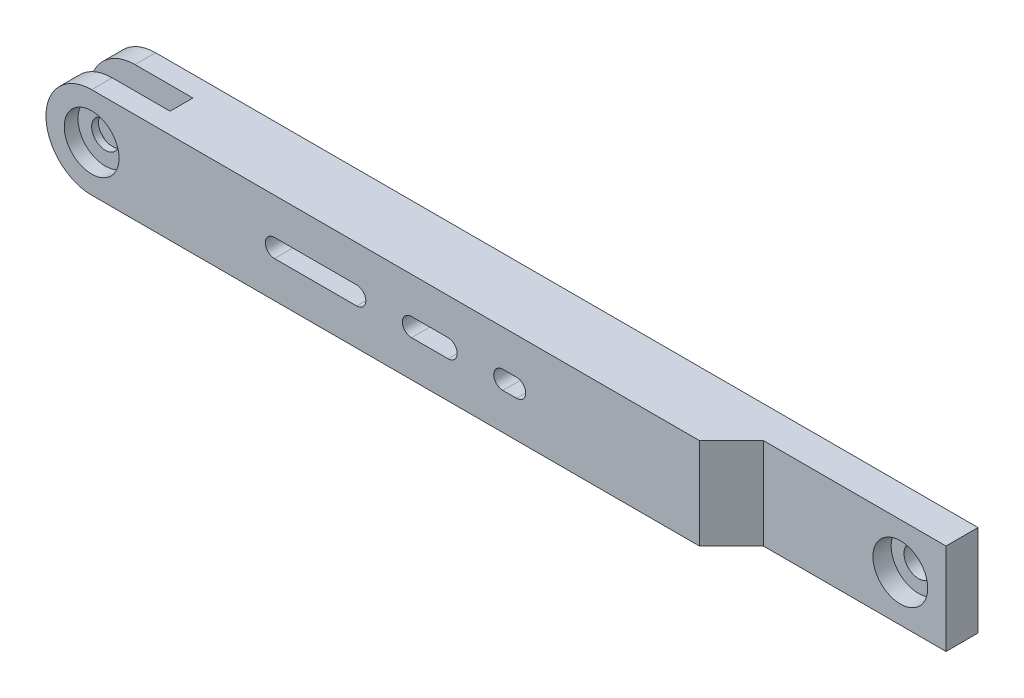
ISO-10303-21;
HEADER;
FILE_DESCRIPTION(('STEP AP214'),'2;1');
FILE_NAME('part.step','',(''),(''),'','','');
FILE_SCHEMA(('AUTOMOTIVE_DESIGN { 1 0 10303 214 1 1 1 1 }'));
ENDSEC;
DATA;
#1=APPLICATION_CONTEXT('core data for automotive mechanical design processes');
#2=APPLICATION_PROTOCOL_DEFINITION('international standard','automotive_design',2000,#1);
#3=PRODUCT_CONTEXT('',#1,'mechanical');
#4=PRODUCT('Part','Part','',(#3));
#5=PRODUCT_RELATED_PRODUCT_CATEGORY('part','',(#4));
#6=PRODUCT_DEFINITION_FORMATION('','',#4);
#7=PRODUCT_DEFINITION_CONTEXT('part definition',#1,'design');
#8=PRODUCT_DEFINITION('design','',#6,#7);
#9=PRODUCT_DEFINITION_SHAPE('','',#8);
#10=(LENGTH_UNIT() NAMED_UNIT(*) SI_UNIT(.MILLI.,.METRE.));
#11=(NAMED_UNIT(*) PLANE_ANGLE_UNIT() SI_UNIT($,.RADIAN.));
#12=(NAMED_UNIT(*) SI_UNIT($,.STERADIAN.) SOLID_ANGLE_UNIT());
#13=UNCERTAINTY_MEASURE_WITH_UNIT(LENGTH_MEASURE(1.E-05),#10,'distance_accuracy_value','');
#14=(GEOMETRIC_REPRESENTATION_CONTEXT(3) GLOBAL_UNCERTAINTY_ASSIGNED_CONTEXT((#13)) GLOBAL_UNIT_ASSIGNED_CONTEXT((#10,
#11,#12)) REPRESENTATION_CONTEXT('',''));
#15=CARTESIAN_POINT('',(0.,0.,0.));
#16=DIRECTION('',(0.,0.,1.));
#17=DIRECTION('',(1.,0.,0.));
#18=AXIS2_PLACEMENT_3D('',#15,#16,#17);
#19=CARTESIAN_POINT('',(-52.2921634722447,0.,-13.));
#20=DIRECTION('',(0.,0.,1.));
#21=DIRECTION('',(1.,0.,0.));
#22=AXIS2_PLACEMENT_3D('',#19,#20,#21);
#23=CYLINDRICAL_SURFACE('',#22,1.5);
#24=CARTESIAN_POINT('',(-52.2921634722447,0.,-5.25));
#25=DIRECTION('',(0.,0.,1.));
#26=DIRECTION('',(1.,0.,0.));
#27=AXIS2_PLACEMENT_3D('',#24,#25,#26);
#28=CIRCLE('',#27,1.5);
#29=CARTESIAN_POINT('',(-50.7921634722447,0.,-5.25));
#30=VERTEX_POINT('',#29);
#31=EDGE_CURVE('E249',#30,#30,#28,.F.);
#32=ORIENTED_EDGE('',*,*,#31,.T.);
#33=EDGE_LOOP('',(#32));
#34=FACE_BOUND('',#33,.T.);
#35=CARTESIAN_POINT('',(-52.2921634722447,0.,-4.5));
#36=DIRECTION('',(0.,0.,1.));
#37=DIRECTION('',(1.,0.,0.));
#38=AXIS2_PLACEMENT_3D('',#35,#36,#37);
#39=CIRCLE('',#38,1.5);
#40=CARTESIAN_POINT('',(-50.7921634722447,0.,-4.5));
#41=VERTEX_POINT('',#40);
#42=EDGE_CURVE('E256',#41,#41,#39,.F.);
#43=ORIENTED_EDGE('',*,*,#42,.F.);
#44=EDGE_LOOP('',(#43));
#45=FACE_BOUND('',#44,.T.);
#46=ADVANCED_FACE('F34',(#34,#45),#23,.F.);
#47=CARTESIAN_POINT('',(-57.2867382607771,-5.,-5.));
#48=DIRECTION('',(1.,0.,0.));
#49=DIRECTION('',(0.,0.,-1.));
#50=AXIS2_PLACEMENT_3D('',#47,#48,#49);
#51=PLANE('',#50);
#52=DIRECTION('',(0.,0.,1.));
#53=VECTOR('',#52,1.);
#54=CARTESIAN_POINT('',(-57.2867382607771,0.232857642684231,-10.));
#55=LINE('',#54,#53);
#56=CARTESIAN_POINT('',(-57.2867382607771,0.232857642684232,-5.25));
#57=VERTEX_POINT('',#56);
#58=CARTESIAN_POINT('',(-57.2867382607771,0.232857642684231,-3.));
#59=VERTEX_POINT('',#58);
#60=EDGE_CURVE('E321',#57,#59,#55,.T.);
#61=ORIENTED_EDGE('',*,*,#60,.F.);
#62=DIRECTION('',(0.,-1.,0.));
#63=VECTOR('',#62,1.);
#64=CARTESIAN_POINT('',(-57.2867382607771,-5.,-5.25));
#65=LINE('',#64,#63);
#66=CARTESIAN_POINT('',(-57.2867382607771,-0.23285764268423,-5.25));
#67=VERTEX_POINT('',#66);
#68=EDGE_CURVE('E244',#57,#67,#65,.T.);
#69=ORIENTED_EDGE('',*,*,#68,.T.);
#70=DIRECTION('',(0.,0.,1.));
#71=VECTOR('',#70,1.);
#72=CARTESIAN_POINT('',(-57.2867382607771,-0.232857642684231,-10.));
#73=LINE('',#72,#71);
#74=CARTESIAN_POINT('',(-57.2867382607771,-0.232857642684231,-3.));
#75=VERTEX_POINT('',#74);
#76=EDGE_CURVE('E301',#67,#75,#73,.T.);
#77=ORIENTED_EDGE('',*,*,#76,.T.);
#78=DIRECTION('',(0.,-1.,0.));
#79=VECTOR('',#78,1.);
#80=CARTESIAN_POINT('',(-57.2867382607771,0.,-3.));
#81=LINE('',#80,#79);
#82=EDGE_CURVE('E351',#59,#75,#81,.T.);
#83=ORIENTED_EDGE('',*,*,#82,.F.);
#84=EDGE_LOOP('',(#61,#69,#77,#83));
#85=FACE_BOUND('',#84,.T.);
#86=ADVANCED_FACE('F443',(#85),#51,.F.);
#87=CARTESIAN_POINT('',(-52.2921634722447,0.,-10.));
#88=DIRECTION('',(0.,0.,1.));
#89=DIRECTION('',(1.,0.,0.));
#90=AXIS2_PLACEMENT_3D('',#87,#88,#89);
#91=CYLINDRICAL_SURFACE('',#90,5.);
#92=CARTESIAN_POINT('',(-52.2921634722447,0.,-5.25));
#93=DIRECTION('',(0.,0.,1.));
#94=DIRECTION('',(1.,0.,0.));
#95=AXIS2_PLACEMENT_3D('',#92,#93,#94);
#96=CIRCLE('',#95,5.);
#97=CARTESIAN_POINT('',(-52.2921634722447,5.,-5.25));
#98=VERTEX_POINT('',#97);
#99=EDGE_CURVE('E247',#57,#98,#96,.F.);
#100=ORIENTED_EDGE('',*,*,#99,.F.);
#101=ORIENTED_EDGE('',*,*,#60,.T.);
#102=CARTESIAN_POINT('',(-52.2921634722447,0.,-3.));
#103=DIRECTION('',(0.,0.,1.));
#104=DIRECTION('',(1.,0.,0.));
#105=AXIS2_PLACEMENT_3D('',#102,#103,#104);
#106=CIRCLE('',#105,5.);
#107=CARTESIAN_POINT('',(-52.2921634722447,5.,-3.));
#108=VERTEX_POINT('',#107);
#109=EDGE_CURVE('E306',#108,#59,#106,.T.);
#110=ORIENTED_EDGE('',*,*,#109,.F.);
#111=DIRECTION('',(0.,0.,1.));
#112=VECTOR('',#111,1.);
#113=CARTESIAN_POINT('',(-52.2921634722447,5.,-10.));
#114=LINE('',#113,#112);
#115=EDGE_CURVE('E314',#98,#108,#114,.T.);
#116=ORIENTED_EDGE('',*,*,#115,.F.);
#117=EDGE_LOOP('',(#100,#101,#110,#116));
#118=FACE_BOUND('',#117,.T.);
#119=ADVANCED_FACE('F450',(#118),#91,.T.);
#120=CARTESIAN_POINT('',(-52.2921634722447,0.,-10.));
#121=DIRECTION('',(0.,0.,1.));
#122=DIRECTION('',(1.,0.,0.));
#123=AXIS2_PLACEMENT_3D('',#120,#121,#122);
#124=CYLINDRICAL_SURFACE('',#123,5.);
#125=CARTESIAN_POINT('',(-52.2921634722447,0.,-5.25));
#126=DIRECTION('',(0.,0.,1.));
#127=DIRECTION('',(1.,0.,0.));
#128=AXIS2_PLACEMENT_3D('',#125,#126,#127);
#129=CIRCLE('',#128,5.);
#130=CARTESIAN_POINT('',(-52.2921634722447,-5.,-5.25));
#131=VERTEX_POINT('',#130);
#132=EDGE_CURVE('E11',#131,#67,#129,.F.);
#133=ORIENTED_EDGE('',*,*,#132,.F.);
#134=DIRECTION('',(0.,0.,1.));
#135=VECTOR('',#134,1.);
#136=CARTESIAN_POINT('',(-52.2921634722447,-5.,-10.));
#137=LINE('',#136,#135);
#138=CARTESIAN_POINT('',(-52.2921634722447,-5.,-3.));
#139=VERTEX_POINT('',#138);
#140=EDGE_CURVE('E307',#131,#139,#137,.T.);
#141=ORIENTED_EDGE('',*,*,#140,.T.);
#142=CARTESIAN_POINT('',(-52.2921634722447,0.,-3.));
#143=DIRECTION('',(0.,0.,1.));
#144=DIRECTION('',(1.,0.,0.));
#145=AXIS2_PLACEMENT_3D('',#142,#143,#144);
#146=CIRCLE('',#145,5.);
#147=EDGE_CURVE('E298',#75,#139,#146,.T.);
#148=ORIENTED_EDGE('',*,*,#147,.F.);
#149=ORIENTED_EDGE('',*,*,#76,.F.);
#150=EDGE_LOOP('',(#133,#141,#148,#149));
#151=FACE_BOUND('',#150,.T.);
#152=ADVANCED_FACE('F456',(#151),#124,.T.);
#153=CARTESIAN_POINT('',(-52.2921634722447,0.,-7.75000000000001));
#154=DIRECTION('',(0.,0.,-1.));
#155=DIRECTION('',(-1.,0.,0.));
#156=AXIS2_PLACEMENT_3D('',#153,#154,#155);
#157=CIRCLE('',#156,1.5);
#158=CARTESIAN_POINT('',(-53.7921634722447,0.,-7.75000000000001));
#159=VERTEX_POINT('',#158);
#160=EDGE_CURVE('E241',#159,#159,#157,.F.);
#161=ORIENTED_EDGE('',*,*,#160,.T.);
#162=EDGE_LOOP('',(#161));
#163=FACE_BOUND('',#162,.T.);
#164=CARTESIAN_POINT('',(-52.2921634722447,0.,-10.));
#165=DIRECTION('',(0.,0.,1.));
#166=DIRECTION('',(1.,0.,0.));
#167=AXIS2_PLACEMENT_3D('',#164,#165,#166);
#168=CIRCLE('',#167,1.5);
#169=CARTESIAN_POINT('',(-50.7921634722447,0.,-10.));
#170=VERTEX_POINT('',#169);
#171=EDGE_CURVE('E259',#170,#170,#168,.T.);
#172=ORIENTED_EDGE('',*,*,#171,.F.);
#173=EDGE_LOOP('',(#172));
#174=FACE_BOUND('',#173,.T.);
#175=ADVANCED_FACE('F446',(#163,#174),#23,.F.);
#176=CARTESIAN_POINT('',(32.7132617392229,0.,-10.));
#177=DIRECTION('',(0.,0.,1.));
#178=DIRECTION('',(1.,0.,0.));
#179=AXIS2_PLACEMENT_3D('',#176,#177,#178);
#180=CYLINDRICAL_SURFACE('',#179,1.6);
#181=CARTESIAN_POINT('',(32.7132617392229,0.,-10.));
#182=DIRECTION('',(0.,0.,1.));
#183=DIRECTION('',(1.,0.,0.));
#184=AXIS2_PLACEMENT_3D('',#181,#182,#183);
#185=CIRCLE('',#184,1.6);
#186=CARTESIAN_POINT('',(34.3132617392229,0.,-10.));
#187=VERTEX_POINT('',#186);
#188=EDGE_CURVE('E282',#187,#187,#185,.T.);
#189=ORIENTED_EDGE('',*,*,#188,.F.);
#190=EDGE_LOOP('',(#189));
#191=FACE_BOUND('',#190,.T.);
#192=CARTESIAN_POINT('',(32.7132617392229,0.,-8.50000000000001));
#193=DIRECTION('',(0.,0.,1.));
#194=DIRECTION('',(1.,0.,0.));
#195=AXIS2_PLACEMENT_3D('',#192,#193,#194);
#196=CIRCLE('',#195,1.6);
#197=CARTESIAN_POINT('',(34.3132617392229,0.,-8.50000000000001));
#198=VERTEX_POINT('',#197);
#199=EDGE_CURVE('E266',#198,#198,#196,.F.);
#200=ORIENTED_EDGE('',*,*,#199,.F.);
#201=EDGE_LOOP('',(#200));
#202=FACE_BOUND('',#201,.T.);
#203=ADVANCED_FACE('F455',(#191,#202),#180,.F.);
#204=CARTESIAN_POINT('',(-57.2867382607771,-0.232857642684231,-10.));
#205=VERTEX_POINT('',#204);
#206=CARTESIAN_POINT('',(-57.2867382607771,-0.232857642684231,-7.75000000000001));
#207=VERTEX_POINT('',#206);
#208=EDGE_CURVE('E308',#205,#207,#73,.T.);
#209=ORIENTED_EDGE('',*,*,#208,.T.);
#210=DIRECTION('',(0.,1.,0.));
#211=VECTOR('',#210,1.);
#212=CARTESIAN_POINT('',(-57.2867382607771,-5.,-7.75000000000001));
#213=LINE('',#212,#211);
#214=CARTESIAN_POINT('',(-57.2867382607771,0.232857642684232,-7.75000000000001));
#215=VERTEX_POINT('',#214);
#216=EDGE_CURVE('E49',#207,#215,#213,.T.);
#217=ORIENTED_EDGE('',*,*,#216,.T.);
#218=CARTESIAN_POINT('',(-57.2867382607771,0.232857642684231,-10.));
#219=VERTEX_POINT('',#218);
#220=EDGE_CURVE('E317',#219,#215,#55,.T.);
#221=ORIENTED_EDGE('',*,*,#220,.F.);
#222=DIRECTION('',(0.,1.,0.));
#223=VECTOR('',#222,1.);
#224=CARTESIAN_POINT('',(-57.2867382607771,-5.,-10.));
#225=LINE('',#224,#223);
#226=EDGE_CURVE('E431',#205,#219,#225,.T.);
#227=ORIENTED_EDGE('',*,*,#226,.F.);
#228=EDGE_LOOP('',(#209,#217,#221,#227));
#229=FACE_BOUND('',#228,.T.);
#230=ADVANCED_FACE('F36',(#229),#51,.F.);
#231=CARTESIAN_POINT('',(-1.55381345925209,-5.,-10.));
#232=DIRECTION('',(0.,0.,1.));
#233=DIRECTION('',(1.,0.,0.));
#234=AXIS2_PLACEMENT_3D('',#231,#232,#233);
#235=PLANE('',#234);
#236=ORIENTED_EDGE('',*,*,#171,.T.);
#237=EDGE_LOOP('',(#236));
#238=FACE_BOUND('',#237,.T.);
#239=ORIENTED_EDGE('',*,*,#188,.T.);
#240=EDGE_LOOP('',(#239));
#241=FACE_BOUND('',#240,.T.);
#242=DIRECTION('',(-1.,0.,0.));
#243=VECTOR('',#242,1.);
#244=CARTESIAN_POINT('',(-7.2867382607771,-1.,-10.));
#245=LINE('',#244,#243);
#246=CARTESIAN_POINT('',(-5.7867382607771,-1.,-10.));
#247=VERTEX_POINT('',#246);
#248=CARTESIAN_POINT('',(-7.2867382607771,-1.,-10.));
#249=VERTEX_POINT('',#248);
#250=EDGE_CURVE('E370',#247,#249,#245,.T.);
#251=ORIENTED_EDGE('',*,*,#250,.F.);
#252=CARTESIAN_POINT('',(-5.7867382607771,0.,-10.));
#253=DIRECTION('',(0.,0.,-1.));
#254=DIRECTION('',(-1.,0.,0.));
#255=AXIS2_PLACEMENT_3D('',#252,#253,#254);
#256=CIRCLE('',#255,1.);
#257=CARTESIAN_POINT('',(-5.7867382607771,0.999999999999999,-10.));
#258=VERTEX_POINT('',#257);
#259=EDGE_CURVE('E368',#258,#247,#256,.T.);
#260=ORIENTED_EDGE('',*,*,#259,.F.);
#261=DIRECTION('',(1.,0.,0.));
#262=VECTOR('',#261,1.);
#263=CARTESIAN_POINT('',(-5.7867382607771,0.999999999999999,-10.));
#264=LINE('',#263,#262);
#265=CARTESIAN_POINT('',(-7.2867382607771,0.999999999999999,-10.));
#266=VERTEX_POINT('',#265);
#267=EDGE_CURVE('E376',#266,#258,#264,.T.);
#268=ORIENTED_EDGE('',*,*,#267,.F.);
#269=CARTESIAN_POINT('',(-7.2867382607771,0.,-10.));
#270=DIRECTION('',(0.,0.,-1.));
#271=DIRECTION('',(-1.,0.,0.));
#272=AXIS2_PLACEMENT_3D('',#269,#270,#271);
#273=CIRCLE('',#272,0.999999999999999);
#274=EDGE_CURVE('E373',#249,#266,#273,.T.);
#275=ORIENTED_EDGE('',*,*,#274,.F.);
#276=EDGE_LOOP('',(#251,#260,#268,#275));
#277=FACE_BOUND('',#276,.T.);
#278=DIRECTION('',(-1.,0.,0.));
#279=VECTOR('',#278,1.);
#280=CARTESIAN_POINT('',(-17.2867382607771,-1.,-10.));
#281=LINE('',#280,#279);
#282=CARTESIAN_POINT('',(-13.2867382607771,-1.,-10.));
#283=VERTEX_POINT('',#282);
#284=CARTESIAN_POINT('',(-17.2867382607771,-1.,-10.));
#285=VERTEX_POINT('',#284);
#286=EDGE_CURVE('E390',#283,#285,#281,.T.);
#287=ORIENTED_EDGE('',*,*,#286,.F.);
#288=CARTESIAN_POINT('',(-13.2867382607771,0.,-10.));
#289=DIRECTION('',(0.,0.,-1.));
#290=DIRECTION('',(-1.,0.,0.));
#291=AXIS2_PLACEMENT_3D('',#288,#289,#290);
#292=CIRCLE('',#291,1.);
#293=CARTESIAN_POINT('',(-13.2867382607771,0.999999999999999,-10.));
#294=VERTEX_POINT('',#293);
#295=EDGE_CURVE('E382',#294,#283,#292,.T.);
#296=ORIENTED_EDGE('',*,*,#295,.F.);
#297=DIRECTION('',(1.,0.,0.));
#298=VECTOR('',#297,1.);
#299=CARTESIAN_POINT('',(-13.2867382607771,0.999999999999999,-10.));
#300=LINE('',#299,#298);
#301=CARTESIAN_POINT('',(-17.2867382607771,0.999999999999999,-10.));
#302=VERTEX_POINT('',#301);
#303=EDGE_CURVE('E396',#302,#294,#300,.T.);
#304=ORIENTED_EDGE('',*,*,#303,.F.);
#305=CARTESIAN_POINT('',(-17.2867382607771,0.,-10.));
#306=DIRECTION('',(0.,0.,-1.));
#307=DIRECTION('',(-1.,0.,0.));
#308=AXIS2_PLACEMENT_3D('',#305,#306,#307);
#309=CIRCLE('',#308,1.);
#310=EDGE_CURVE('E393',#285,#302,#309,.T.);
#311=ORIENTED_EDGE('',*,*,#310,.F.);
#312=EDGE_LOOP('',(#287,#296,#304,#311));
#313=FACE_BOUND('',#312,.T.);
#314=DIRECTION('',(-1.,0.,0.));
#315=VECTOR('',#314,1.);
#316=CARTESIAN_POINT('',(-32.2867382607771,-0.999999999999999,-10.));
#317=LINE('',#316,#315);
#318=CARTESIAN_POINT('',(-23.2867382607771,-0.999999999999999,-10.));
#319=VERTEX_POINT('',#318);
#320=CARTESIAN_POINT('',(-32.2867382607771,-0.999999999999999,-10.));
#321=VERTEX_POINT('',#320);
#322=EDGE_CURVE('E410',#319,#321,#317,.T.);
#323=ORIENTED_EDGE('',*,*,#322,.F.);
#324=CARTESIAN_POINT('',(-23.2867382607771,0.,-10.));
#325=DIRECTION('',(0.,0.,-1.));
#326=DIRECTION('',(-1.,0.,0.));
#327=AXIS2_PLACEMENT_3D('',#324,#325,#326);
#328=CIRCLE('',#327,0.999999999999998);
#329=CARTESIAN_POINT('',(-23.2867382607771,0.999999999999996,-10.));
#330=VERTEX_POINT('',#329);
#331=EDGE_CURVE('E402',#330,#319,#328,.T.);
#332=ORIENTED_EDGE('',*,*,#331,.F.);
#333=DIRECTION('',(1.,0.,0.));
#334=VECTOR('',#333,1.);
#335=CARTESIAN_POINT('',(-23.2867382607771,0.999999999999996,-10.));
#336=LINE('',#335,#334);
#337=CARTESIAN_POINT('',(-32.2867382607771,0.999999999999997,-10.));
#338=VERTEX_POINT('',#337);
#339=EDGE_CURVE('E416',#338,#330,#336,.T.);
#340=ORIENTED_EDGE('',*,*,#339,.F.);
#341=CARTESIAN_POINT('',(-32.2867382607771,0.,-10.));
#342=DIRECTION('',(0.,0.,-1.));
#343=DIRECTION('',(-1.,0.,0.));
#344=AXIS2_PLACEMENT_3D('',#341,#342,#343);
#345=CIRCLE('',#344,0.999999999999998);
#346=EDGE_CURVE('E413',#321,#338,#345,.T.);
#347=ORIENTED_EDGE('',*,*,#346,.F.);
#348=EDGE_LOOP('',(#323,#332,#340,#347));
#349=FACE_BOUND('',#348,.T.);
#350=DIRECTION('',(0.,1.,0.));
#351=VECTOR('',#350,1.);
#352=CARTESIAN_POINT('',(37.7132617392229,-5.,-10.));
#353=LINE('',#352,#351);
#354=CARTESIAN_POINT('',(37.7132617392229,-5.,-10.));
#355=VERTEX_POINT('',#354);
#356=CARTESIAN_POINT('',(37.7132617392229,5.,-10.));
#357=VERTEX_POINT('',#356);
#358=EDGE_CURVE('E292',#355,#357,#353,.T.);
#359=ORIENTED_EDGE('',*,*,#358,.F.);
#360=DIRECTION('',(1.,0.,0.));
#361=VECTOR('',#360,1.);
#362=CARTESIAN_POINT('',(-1.55381345925209,-5.,-10.));
#363=LINE('',#362,#361);
#364=CARTESIAN_POINT('',(-52.2921634722447,-5.,-10.));
#365=VERTEX_POINT('',#364);
#366=EDGE_CURVE('E429',#365,#355,#363,.T.);
#367=ORIENTED_EDGE('',*,*,#366,.F.);
#368=CARTESIAN_POINT('',(-52.2921634722447,0.,-10.));
#369=DIRECTION('',(0.,0.,1.));
#370=DIRECTION('',(1.,0.,0.));
#371=AXIS2_PLACEMENT_3D('',#368,#369,#370);
#372=CIRCLE('',#371,5.);
#373=EDGE_CURVE('E299',#205,#365,#372,.T.);
#374=ORIENTED_EDGE('',*,*,#373,.F.);
#375=ORIENTED_EDGE('',*,*,#226,.T.);
#376=CARTESIAN_POINT('',(-52.2921634722447,0.,-10.));
#377=DIRECTION('',(0.,0.,1.));
#378=DIRECTION('',(1.,0.,0.));
#379=AXIS2_PLACEMENT_3D('',#376,#377,#378);
#380=CIRCLE('',#379,5.);
#381=CARTESIAN_POINT('',(-52.2921634722447,5.,-10.));
#382=VERTEX_POINT('',#381);
#383=EDGE_CURVE('E311',#382,#219,#380,.T.);
#384=ORIENTED_EDGE('',*,*,#383,.F.);
#385=DIRECTION('',(1.,0.,0.));
#386=VECTOR('',#385,1.);
#387=CARTESIAN_POINT('',(-1.55381345925209,5.,-10.));
#388=LINE('',#387,#386);
#389=EDGE_CURVE('E422',#382,#357,#388,.T.);
#390=ORIENTED_EDGE('',*,*,#389,.T.);
#391=EDGE_LOOP('',(#359,#367,#374,#375,#384,#390));
#392=FACE_BOUND('',#391,.T.);
#393=ADVANCED_FACE('F471',(#238,#241,#277,#313,#349,#392),#235,.F.);
#394=CARTESIAN_POINT('',(0.,0.,-3.));
#395=DIRECTION('',(0.,0.,1.));
#396=DIRECTION('',(1.,0.,0.));
#397=AXIS2_PLACEMENT_3D('',#394,#395,#396);
#398=PLANE('',#397);
#399=CARTESIAN_POINT('',(-52.2921634722447,0.,-3.));
#400=DIRECTION('',(0.,0.,1.));
#401=DIRECTION('',(1.,0.,0.));
#402=AXIS2_PLACEMENT_3D('',#399,#400,#401);
#403=CIRCLE('',#402,3.);
#404=CARTESIAN_POINT('',(-49.2921634722447,0.,-3.));
#405=VERTEX_POINT('',#404);
#406=EDGE_CURVE('E252',#405,#405,#403,.T.);
#407=ORIENTED_EDGE('',*,*,#406,.F.);
#408=EDGE_LOOP('',(#407));
#409=FACE_BOUND('',#408,.T.);
#410=DIRECTION('',(-1.,0.,0.));
#411=VECTOR('',#410,1.);
#412=CARTESIAN_POINT('',(0.,5.,-3.));
#413=LINE('',#412,#411);
#414=CARTESIAN_POINT('',(14.2132617392229,5.,-3.));
#415=VERTEX_POINT('',#414);
#416=EDGE_CURVE('E348',#415,#108,#413,.T.);
#417=ORIENTED_EDGE('',*,*,#416,.T.);
#418=ORIENTED_EDGE('',*,*,#109,.T.);
#419=ORIENTED_EDGE('',*,*,#82,.T.);
#420=ORIENTED_EDGE('',*,*,#147,.T.);
#421=DIRECTION('',(1.,0.,0.));
#422=VECTOR('',#421,1.);
#423=CARTESIAN_POINT('',(0.,-5.,-3.));
#424=LINE('',#423,#422);
#425=CARTESIAN_POINT('',(14.2132617392229,-5.,-3.));
#426=VERTEX_POINT('',#425);
#427=EDGE_CURVE('E354',#139,#426,#424,.T.);
#428=ORIENTED_EDGE('',*,*,#427,.T.);
#429=DIRECTION('',(0.,-1.,0.));
#430=VECTOR('',#429,1.);
#431=CARTESIAN_POINT('',(14.2132617392229,5.,-3.));
#432=LINE('',#431,#430);
#433=EDGE_CURVE('E275',#415,#426,#432,.T.);
#434=ORIENTED_EDGE('',*,*,#433,.F.);
#435=EDGE_LOOP('',(#417,#418,#419,#420,#428,#434));
#436=FACE_BOUND('',#435,.T.);
#437=CARTESIAN_POINT('',(-7.2867382607771,0.,-3.));
#438=DIRECTION('',(0.,0.,1.));
#439=DIRECTION('',(1.,0.,0.));
#440=AXIS2_PLACEMENT_3D('',#437,#438,#439);
#441=CIRCLE('',#440,0.999999999999999);
#442=CARTESIAN_POINT('',(-7.2867382607771,-1.,-3.));
#443=VERTEX_POINT('',#442);
#444=CARTESIAN_POINT('',(-7.2867382607771,0.999999999999999,-3.));
#445=VERTEX_POINT('',#444);
#446=EDGE_CURVE('E320',#443,#445,#441,.F.);
#447=ORIENTED_EDGE('',*,*,#446,.T.);
#448=DIRECTION('',(1.,0.,0.));
#449=VECTOR('',#448,1.);
#450=CARTESIAN_POINT('',(0.,0.999999999999999,-3.));
#451=LINE('',#450,#449);
#452=CARTESIAN_POINT('',(-5.7867382607771,0.999999999999999,-3.));
#453=VERTEX_POINT('',#452);
#454=EDGE_CURVE('E327',#445,#453,#451,.T.);
#455=ORIENTED_EDGE('',*,*,#454,.T.);
#456=CARTESIAN_POINT('',(-5.7867382607771,0.,-3.));
#457=DIRECTION('',(0.,0.,1.));
#458=DIRECTION('',(1.,0.,0.));
#459=AXIS2_PLACEMENT_3D('',#456,#457,#458);
#460=CIRCLE('',#459,1.);
#461=CARTESIAN_POINT('',(-5.7867382607771,-1.,-3.));
#462=VERTEX_POINT('',#461);
#463=EDGE_CURVE('E330',#453,#462,#460,.F.);
#464=ORIENTED_EDGE('',*,*,#463,.T.);
#465=DIRECTION('',(-1.,0.,0.));
#466=VECTOR('',#465,1.);
#467=CARTESIAN_POINT('',(0.,-1.,-3.));
#468=LINE('',#467,#466);
#469=EDGE_CURVE('E333',#462,#443,#468,.T.);
#470=ORIENTED_EDGE('',*,*,#469,.T.);
#471=EDGE_LOOP('',(#447,#455,#464,#470));
#472=FACE_BOUND('',#471,.T.);
#473=CARTESIAN_POINT('',(-32.2867382607771,0.,-3.));
#474=DIRECTION('',(0.,0.,1.));
#475=DIRECTION('',(1.,0.,0.));
#476=AXIS2_PLACEMENT_3D('',#473,#474,#475);
#477=CIRCLE('',#476,0.999999999999998);
#478=CARTESIAN_POINT('',(-32.2867382607771,-0.999999999999999,-3.));
#479=VERTEX_POINT('',#478);
#480=CARTESIAN_POINT('',(-32.2867382607771,0.999999999999996,-3.));
#481=VERTEX_POINT('',#480);
#482=EDGE_CURVE('E336',#479,#481,#477,.F.);
#483=ORIENTED_EDGE('',*,*,#482,.T.);
#484=DIRECTION('',(1.,0.,0.));
#485=VECTOR('',#484,1.);
#486=CARTESIAN_POINT('',(0.,0.999999999999996,-3.));
#487=LINE('',#486,#485);
#488=CARTESIAN_POINT('',(-23.2867382607771,0.999999999999997,-3.));
#489=VERTEX_POINT('',#488);
#490=EDGE_CURVE('E339',#481,#489,#487,.T.);
#491=ORIENTED_EDGE('',*,*,#490,.T.);
#492=CARTESIAN_POINT('',(-23.2867382607771,0.,-3.));
#493=DIRECTION('',(0.,0.,1.));
#494=DIRECTION('',(1.,0.,0.));
#495=AXIS2_PLACEMENT_3D('',#492,#493,#494);
#496=CIRCLE('',#495,0.999999999999998);
#497=CARTESIAN_POINT('',(-23.2867382607771,-0.999999999999999,-3.));
#498=VERTEX_POINT('',#497);
#499=EDGE_CURVE('E342',#489,#498,#496,.F.);
#500=ORIENTED_EDGE('',*,*,#499,.T.);
#501=DIRECTION('',(-1.,0.,0.));
#502=VECTOR('',#501,1.);
#503=CARTESIAN_POINT('',(0.,-1.,-3.));
#504=LINE('',#503,#502);
#505=EDGE_CURVE('E345',#498,#479,#504,.T.);
#506=ORIENTED_EDGE('',*,*,#505,.T.);
#507=EDGE_LOOP('',(#483,#491,#500,#506));
#508=FACE_BOUND('',#507,.T.);
#509=CARTESIAN_POINT('',(-17.2867382607771,0.,-3.));
#510=DIRECTION('',(0.,0.,1.));
#511=DIRECTION('',(1.,0.,0.));
#512=AXIS2_PLACEMENT_3D('',#509,#510,#511);
#513=CIRCLE('',#512,1.);
#514=CARTESIAN_POINT('',(-17.2867382607771,-1.,-3.));
#515=VERTEX_POINT('',#514);
#516=CARTESIAN_POINT('',(-17.2867382607771,0.999999999999999,-3.));
#517=VERTEX_POINT('',#516);
#518=EDGE_CURVE('E356',#515,#517,#513,.F.);
#519=ORIENTED_EDGE('',*,*,#518,.T.);
#520=DIRECTION('',(1.,0.,0.));
#521=VECTOR('',#520,1.);
#522=CARTESIAN_POINT('',(0.,0.999999999999999,-3.));
#523=LINE('',#522,#521);
#524=CARTESIAN_POINT('',(-13.2867382607771,0.999999999999999,-3.));
#525=VERTEX_POINT('',#524);
#526=EDGE_CURVE('E359',#517,#525,#523,.T.);
#527=ORIENTED_EDGE('',*,*,#526,.T.);
#528=CARTESIAN_POINT('',(-13.2867382607771,0.,-3.));
#529=DIRECTION('',(0.,0.,1.));
#530=DIRECTION('',(1.,0.,0.));
#531=AXIS2_PLACEMENT_3D('',#528,#529,#530);
#532=CIRCLE('',#531,1.);
#533=CARTESIAN_POINT('',(-13.2867382607771,-1.,-3.));
#534=VERTEX_POINT('',#533);
#535=EDGE_CURVE('E362',#525,#534,#532,.F.);
#536=ORIENTED_EDGE('',*,*,#535,.T.);
#537=DIRECTION('',(-1.,0.,0.));
#538=VECTOR('',#537,1.);
#539=CARTESIAN_POINT('',(0.,-1.,-3.));
#540=LINE('',#539,#538);
#541=EDGE_CURVE('E365',#534,#515,#540,.T.);
#542=ORIENTED_EDGE('',*,*,#541,.T.);
#543=EDGE_LOOP('',(#519,#527,#536,#542));
#544=FACE_BOUND('',#543,.T.);
#545=ADVANCED_FACE('F474',(#409,#436,#472,#508,#544),#398,.T.);
#546=CARTESIAN_POINT('',(0.,-5.,0.));
#547=DIRECTION('',(0.,-1.,0.));
#548=DIRECTION('',(0.,0.,-1.));
#549=AXIS2_PLACEMENT_3D('',#546,#547,#548);
#550=PLANE('',#549);
#551=DIRECTION('',(1.,0.,0.));
#552=VECTOR('',#551,1.);
#553=CARTESIAN_POINT('',(-87.1338043737681,-5.,-5.25));
#554=LINE('',#553,#552);
#555=CARTESIAN_POINT('',(-45.9564821058587,-5.,-5.25));
#556=VERTEX_POINT('',#555);
#557=EDGE_CURVE('E217',#131,#556,#554,.T.);
#558=ORIENTED_EDGE('',*,*,#557,.T.);
#559=DIRECTION('',(0.,0.,-1.));
#560=VECTOR('',#559,1.);
#561=CARTESIAN_POINT('',(-45.9564821058587,-5.,-5.25));
#562=LINE('',#561,#560);
#563=CARTESIAN_POINT('',(-45.9564821058587,-5.,-7.75000000000001));
#564=VERTEX_POINT('',#563);
#565=EDGE_CURVE('E211',#556,#564,#562,.T.);
#566=ORIENTED_EDGE('',*,*,#565,.T.);
#567=DIRECTION('',(-1.,0.,0.));
#568=VECTOR('',#567,1.);
#569=CARTESIAN_POINT('',(-87.1338043737681,-5.,-7.75000000000001));
#570=LINE('',#569,#568);
#571=CARTESIAN_POINT('',(-52.2921634722447,-5.,-7.75000000000001));
#572=VERTEX_POINT('',#571);
#573=EDGE_CURVE('E220',#564,#572,#570,.T.);
#574=ORIENTED_EDGE('',*,*,#573,.T.);
#575=EDGE_CURVE('E304',#365,#572,#137,.T.);
#576=ORIENTED_EDGE('',*,*,#575,.F.);
#577=ORIENTED_EDGE('',*,*,#366,.T.);
#578=DIRECTION('',(0.,0.,-1.));
#579=VECTOR('',#578,1.);
#580=CARTESIAN_POINT('',(37.7132617392229,-5.,-3.));
#581=LINE('',#580,#579);
#582=CARTESIAN_POINT('',(37.7132617392229,-5.,-6.50000000000001));
#583=VERTEX_POINT('',#582);
#584=EDGE_CURVE('E289',#583,#355,#581,.T.);
#585=ORIENTED_EDGE('',*,*,#584,.F.);
#586=DIRECTION('',(1.,0.,0.));
#587=VECTOR('',#586,1.);
#588=CARTESIAN_POINT('',(37.7132617392229,-5.,-6.5));
#589=LINE('',#588,#587);
#590=CARTESIAN_POINT('',(17.7132617392229,-5.,-6.50000000000001));
#591=VERTEX_POINT('',#590);
#592=EDGE_CURVE('E57',#591,#583,#589,.T.);
#593=ORIENTED_EDGE('',*,*,#592,.F.);
#594=DIRECTION('',(0.707106781186551,0.,-0.707106781186544));
#595=VECTOR('',#594,1.);
#596=CARTESIAN_POINT('',(17.7132617392229,-5.,-6.50000000000001));
#597=LINE('',#596,#595);
#598=EDGE_CURVE('E276',#426,#591,#597,.T.);
#599=ORIENTED_EDGE('',*,*,#598,.F.);
#600=ORIENTED_EDGE('',*,*,#427,.F.);
#601=ORIENTED_EDGE('',*,*,#140,.F.);
#602=EDGE_LOOP('',(#558,#566,#574,#576,#577,#585,#593,#599,#600,#601));
#603=FACE_BOUND('',#602,.T.);
#604=ADVANCED_FACE('F227',(#603),#550,.T.);
#605=CARTESIAN_POINT('',(0.,5.,0.));
#606=DIRECTION('',(0.,-1.,0.));
#607=DIRECTION('',(0.,0.,-1.));
#608=AXIS2_PLACEMENT_3D('',#605,#606,#607);
#609=PLANE('',#608);
#610=DIRECTION('',(0.,0.,-1.));
#611=VECTOR('',#610,1.);
#612=CARTESIAN_POINT('',(-45.9564821058587,5.,-5.25));
#613=LINE('',#612,#611);
#614=CARTESIAN_POINT('',(-45.9564821058587,5.,-5.25));
#615=VERTEX_POINT('',#614);
#616=CARTESIAN_POINT('',(-45.9564821058587,5.,-7.75000000000001));
#617=VERTEX_POINT('',#616);
#618=EDGE_CURVE('E214',#615,#617,#613,.T.);
#619=ORIENTED_EDGE('',*,*,#618,.F.);
#620=DIRECTION('',(1.,0.,0.));
#621=VECTOR('',#620,1.);
#622=CARTESIAN_POINT('',(-87.1338043737681,5.,-5.25));
#623=LINE('',#622,#621);
#624=EDGE_CURVE('E229',#98,#615,#623,.T.);
#625=ORIENTED_EDGE('',*,*,#624,.F.);
#626=ORIENTED_EDGE('',*,*,#115,.T.);
#627=ORIENTED_EDGE('',*,*,#416,.F.);
#628=DIRECTION('',(0.707106781186551,0.,-0.707106781186544));
#629=VECTOR('',#628,1.);
#630=CARTESIAN_POINT('',(17.7132617392229,5.,-6.50000000000001));
#631=LINE('',#630,#629);
#632=CARTESIAN_POINT('',(17.7132617392229,5.,-6.50000000000001));
#633=VERTEX_POINT('',#632);
#634=EDGE_CURVE('E269',#415,#633,#631,.T.);
#635=ORIENTED_EDGE('',*,*,#634,.T.);
#636=DIRECTION('',(1.,0.,0.));
#637=VECTOR('',#636,1.);
#638=CARTESIAN_POINT('',(37.7132617392229,5.,-6.5));
#639=LINE('',#638,#637);
#640=CARTESIAN_POINT('',(37.7132617392229,5.,-6.5));
#641=VERTEX_POINT('',#640);
#642=EDGE_CURVE('E272',#633,#641,#639,.T.);
#643=ORIENTED_EDGE('',*,*,#642,.T.);
#644=DIRECTION('',(0.,0.,1.));
#645=VECTOR('',#644,1.);
#646=CARTESIAN_POINT('',(37.7132617392229,5.,-10.));
#647=LINE('',#646,#645);
#648=EDGE_CURVE('E295',#357,#641,#647,.T.);
#649=ORIENTED_EDGE('',*,*,#648,.F.);
#650=ORIENTED_EDGE('',*,*,#389,.F.);
#651=CARTESIAN_POINT('',(-52.2921634722447,5.,-7.75000000000001));
#652=VERTEX_POINT('',#651);
#653=EDGE_CURVE('E322',#382,#652,#114,.T.);
#654=ORIENTED_EDGE('',*,*,#653,.T.);
#655=DIRECTION('',(-1.,0.,0.));
#656=VECTOR('',#655,1.);
#657=CARTESIAN_POINT('',(-87.1338043737681,5.,-7.75000000000001));
#658=LINE('',#657,#656);
#659=EDGE_CURVE('E231',#617,#652,#658,.T.);
#660=ORIENTED_EDGE('',*,*,#659,.F.);
#661=EDGE_LOOP('',(#619,#625,#626,#627,#635,#643,#649,#650,#654,#660));
#662=FACE_BOUND('',#661,.T.);
#663=ADVANCED_FACE('F499',(#662),#609,.F.);
#664=CARTESIAN_POINT('',(-23.2867382607771,0.,0.));
#665=DIRECTION('',(0.,0.,-1.));
#666=DIRECTION('',(-1.,0.,0.));
#667=AXIS2_PLACEMENT_3D('',#664,#665,#666);
#668=CYLINDRICAL_SURFACE('',#667,0.999999999999998);
#669=DIRECTION('',(0.,0.,-1.));
#670=VECTOR('',#669,1.);
#671=CARTESIAN_POINT('',(-23.2867382607771,0.999999999999996,0.));
#672=LINE('',#671,#670);
#673=EDGE_CURVE('E420',#489,#330,#672,.T.);
#674=ORIENTED_EDGE('',*,*,#673,.T.);
#675=ORIENTED_EDGE('',*,*,#331,.T.);
#676=DIRECTION('',(0.,0.,-1.));
#677=VECTOR('',#676,1.);
#678=CARTESIAN_POINT('',(-23.2867382607771,-1.,0.));
#679=LINE('',#678,#677);
#680=EDGE_CURVE('E419',#498,#319,#679,.T.);
#681=ORIENTED_EDGE('',*,*,#680,.F.);
#682=ORIENTED_EDGE('',*,*,#499,.F.);
#683=EDGE_LOOP('',(#674,#675,#681,#682));
#684=FACE_BOUND('',#683,.T.);
#685=ADVANCED_FACE('F585',(#684),#668,.F.);
#686=CARTESIAN_POINT('',(-23.2867382607771,0.999999999999996,0.));
#687=DIRECTION('',(0.,1.,0.));
#688=DIRECTION('',(-1.,0.,0.));
#689=AXIS2_PLACEMENT_3D('',#686,#687,#688);
#690=PLANE('',#689);
#691=DIRECTION('',(0.,0.,-1.));
#692=VECTOR('',#691,1.);
#693=CARTESIAN_POINT('',(-32.2867382607771,0.999999999999997,0.));
#694=LINE('',#693,#692);
#695=EDGE_CURVE('E423',#481,#338,#694,.T.);
#696=ORIENTED_EDGE('',*,*,#695,.T.);
#697=ORIENTED_EDGE('',*,*,#339,.T.);
#698=ORIENTED_EDGE('',*,*,#673,.F.);
#699=ORIENTED_EDGE('',*,*,#490,.F.);
#700=EDGE_LOOP('',(#696,#697,#698,#699));
#701=FACE_BOUND('',#700,.T.);
#702=ADVANCED_FACE('F581',(#701),#690,.F.);
#703=CARTESIAN_POINT('',(-32.2867382607771,0.,0.));
#704=DIRECTION('',(0.,0.,-1.));
#705=DIRECTION('',(-1.,0.,0.));
#706=AXIS2_PLACEMENT_3D('',#703,#704,#705);
#707=CYLINDRICAL_SURFACE('',#706,0.999999999999998);
#708=DIRECTION('',(0.,0.,-1.));
#709=VECTOR('',#708,1.);
#710=CARTESIAN_POINT('',(-32.2867382607771,-0.999999999999999,0.));
#711=LINE('',#710,#709);
#712=EDGE_CURVE('E425',#479,#321,#711,.T.);
#713=ORIENTED_EDGE('',*,*,#712,.T.);
#714=ORIENTED_EDGE('',*,*,#346,.T.);
#715=ORIENTED_EDGE('',*,*,#695,.F.);
#716=ORIENTED_EDGE('',*,*,#482,.F.);
#717=EDGE_LOOP('',(#713,#714,#715,#716));
#718=FACE_BOUND('',#717,.T.);
#719=ADVANCED_FACE('F584',(#718),#707,.F.);
#720=CARTESIAN_POINT('',(-32.2867382607771,-0.999999999999999,0.));
#721=DIRECTION('',(0.,-1.,0.));
#722=DIRECTION('',(1.,0.,0.));
#723=AXIS2_PLACEMENT_3D('',#720,#721,#722);
#724=PLANE('',#723);
#725=ORIENTED_EDGE('',*,*,#680,.T.);
#726=ORIENTED_EDGE('',*,*,#322,.T.);
#727=ORIENTED_EDGE('',*,*,#712,.F.);
#728=ORIENTED_EDGE('',*,*,#505,.F.);
#729=EDGE_LOOP('',(#725,#726,#727,#728));
#730=FACE_BOUND('',#729,.T.);
#731=ADVANCED_FACE('F579',(#730),#724,.F.);
#732=CARTESIAN_POINT('',(-13.2867382607771,0.,0.));
#733=DIRECTION('',(0.,0.,-1.));
#734=DIRECTION('',(-1.,0.,0.));
#735=AXIS2_PLACEMENT_3D('',#732,#733,#734);
#736=CYLINDRICAL_SURFACE('',#735,1.);
#737=DIRECTION('',(0.,0.,-1.));
#738=VECTOR('',#737,1.);
#739=CARTESIAN_POINT('',(-13.2867382607771,0.999999999999999,0.));
#740=LINE('',#739,#738);
#741=EDGE_CURVE('E400',#525,#294,#740,.T.);
#742=ORIENTED_EDGE('',*,*,#741,.T.);
#743=ORIENTED_EDGE('',*,*,#295,.T.);
#744=DIRECTION('',(0.,0.,-1.));
#745=VECTOR('',#744,1.);
#746=CARTESIAN_POINT('',(-13.2867382607771,-1.,0.));
#747=LINE('',#746,#745);
#748=EDGE_CURVE('E399',#534,#283,#747,.T.);
#749=ORIENTED_EDGE('',*,*,#748,.F.);
#750=ORIENTED_EDGE('',*,*,#535,.F.);
#751=EDGE_LOOP('',(#742,#743,#749,#750));
#752=FACE_BOUND('',#751,.T.);
#753=ADVANCED_FACE('F569',(#752),#736,.F.);
#754=CARTESIAN_POINT('',(-13.2867382607771,0.999999999999999,0.));
#755=DIRECTION('',(0.,1.,0.));
#756=DIRECTION('',(0.,0.,1.));
#757=AXIS2_PLACEMENT_3D('',#754,#755,#756);
#758=PLANE('',#757);
#759=DIRECTION('',(0.,0.,-1.));
#760=VECTOR('',#759,1.);
#761=CARTESIAN_POINT('',(-17.2867382607771,0.999999999999999,0.));
#762=LINE('',#761,#760);
#763=EDGE_CURVE('E403',#517,#302,#762,.T.);
#764=ORIENTED_EDGE('',*,*,#763,.T.);
#765=ORIENTED_EDGE('',*,*,#303,.T.);
#766=ORIENTED_EDGE('',*,*,#741,.F.);
#767=ORIENTED_EDGE('',*,*,#526,.F.);
#768=EDGE_LOOP('',(#764,#765,#766,#767));
#769=FACE_BOUND('',#768,.T.);
#770=ADVANCED_FACE('F565',(#769),#758,.F.);
#771=CARTESIAN_POINT('',(-17.2867382607771,0.,0.));
#772=DIRECTION('',(0.,0.,-1.));
#773=DIRECTION('',(-1.,0.,0.));
#774=AXIS2_PLACEMENT_3D('',#771,#772,#773);
#775=CYLINDRICAL_SURFACE('',#774,1.);
#776=DIRECTION('',(0.,0.,-1.));
#777=VECTOR('',#776,1.);
#778=CARTESIAN_POINT('',(-17.2867382607771,-1.,0.));
#779=LINE('',#778,#777);
#780=EDGE_CURVE('E405',#515,#285,#779,.T.);
#781=ORIENTED_EDGE('',*,*,#780,.T.);
#782=ORIENTED_EDGE('',*,*,#310,.T.);
#783=ORIENTED_EDGE('',*,*,#763,.F.);
#784=ORIENTED_EDGE('',*,*,#518,.F.);
#785=EDGE_LOOP('',(#781,#782,#783,#784));
#786=FACE_BOUND('',#785,.T.);
#787=ADVANCED_FACE('F568',(#786),#775,.F.);
#788=CARTESIAN_POINT('',(-17.2867382607771,-1.,0.));
#789=DIRECTION('',(0.,-1.,0.));
#790=DIRECTION('',(0.,0.,-1.));
#791=AXIS2_PLACEMENT_3D('',#788,#789,#790);
#792=PLANE('',#791);
#793=ORIENTED_EDGE('',*,*,#748,.T.);
#794=ORIENTED_EDGE('',*,*,#286,.T.);
#795=ORIENTED_EDGE('',*,*,#780,.F.);
#796=ORIENTED_EDGE('',*,*,#541,.F.);
#797=EDGE_LOOP('',(#793,#794,#795,#796));
#798=FACE_BOUND('',#797,.T.);
#799=ADVANCED_FACE('F563',(#798),#792,.F.);
#800=CARTESIAN_POINT('',(-5.7867382607771,0.,0.));
#801=DIRECTION('',(0.,0.,-1.));
#802=DIRECTION('',(-1.,0.,0.));
#803=AXIS2_PLACEMENT_3D('',#800,#801,#802);
#804=CYLINDRICAL_SURFACE('',#803,1.);
#805=DIRECTION('',(0.,0.,-1.));
#806=VECTOR('',#805,1.);
#807=CARTESIAN_POINT('',(-5.7867382607771,0.999999999999999,0.));
#808=LINE('',#807,#806);
#809=EDGE_CURVE('E380',#453,#258,#808,.T.);
#810=ORIENTED_EDGE('',*,*,#809,.T.);
#811=ORIENTED_EDGE('',*,*,#259,.T.);
#812=DIRECTION('',(0.,0.,-1.));
#813=VECTOR('',#812,1.);
#814=CARTESIAN_POINT('',(-5.7867382607771,-1.,0.));
#815=LINE('',#814,#813);
#816=EDGE_CURVE('E379',#462,#247,#815,.T.);
#817=ORIENTED_EDGE('',*,*,#816,.F.);
#818=ORIENTED_EDGE('',*,*,#463,.F.);
#819=EDGE_LOOP('',(#810,#811,#817,#818));
#820=FACE_BOUND('',#819,.T.);
#821=ADVANCED_FACE('F553',(#820),#804,.F.);
#822=CARTESIAN_POINT('',(-5.7867382607771,0.999999999999999,0.));
#823=DIRECTION('',(0.,1.,0.));
#824=DIRECTION('',(-1.,0.,0.));
#825=AXIS2_PLACEMENT_3D('',#822,#823,#824);
#826=PLANE('',#825);
#827=DIRECTION('',(0.,0.,-1.));
#828=VECTOR('',#827,1.);
#829=CARTESIAN_POINT('',(-7.2867382607771,0.999999999999999,0.));
#830=LINE('',#829,#828);
#831=EDGE_CURVE('E383',#445,#266,#830,.T.);
#832=ORIENTED_EDGE('',*,*,#831,.T.);
#833=ORIENTED_EDGE('',*,*,#267,.T.);
#834=ORIENTED_EDGE('',*,*,#809,.F.);
#835=ORIENTED_EDGE('',*,*,#454,.F.);
#836=EDGE_LOOP('',(#832,#833,#834,#835));
#837=FACE_BOUND('',#836,.T.);
#838=ADVANCED_FACE('F549',(#837),#826,.F.);
#839=CARTESIAN_POINT('',(-7.2867382607771,0.,0.));
#840=DIRECTION('',(0.,0.,-1.));
#841=DIRECTION('',(-1.,0.,0.));
#842=AXIS2_PLACEMENT_3D('',#839,#840,#841);
#843=CYLINDRICAL_SURFACE('',#842,0.999999999999999);
#844=DIRECTION('',(0.,0.,-1.));
#845=VECTOR('',#844,1.);
#846=CARTESIAN_POINT('',(-7.2867382607771,-1.,0.));
#847=LINE('',#846,#845);
#848=EDGE_CURVE('E385',#443,#249,#847,.T.);
#849=ORIENTED_EDGE('',*,*,#848,.T.);
#850=ORIENTED_EDGE('',*,*,#274,.T.);
#851=ORIENTED_EDGE('',*,*,#831,.F.);
#852=ORIENTED_EDGE('',*,*,#446,.F.);
#853=EDGE_LOOP('',(#849,#850,#851,#852));
#854=FACE_BOUND('',#853,.T.);
#855=ADVANCED_FACE('F552',(#854),#843,.F.);
#856=CARTESIAN_POINT('',(-7.2867382607771,-1.,0.));
#857=DIRECTION('',(0.,-1.,0.));
#858=DIRECTION('',(1.,0.,0.));
#859=AXIS2_PLACEMENT_3D('',#856,#857,#858);
#860=PLANE('',#859);
#861=ORIENTED_EDGE('',*,*,#816,.T.);
#862=ORIENTED_EDGE('',*,*,#250,.T.);
#863=ORIENTED_EDGE('',*,*,#848,.F.);
#864=ORIENTED_EDGE('',*,*,#469,.F.);
#865=EDGE_LOOP('',(#861,#862,#863,#864));
#866=FACE_BOUND('',#865,.T.);
#867=ADVANCED_FACE('F545',(#866),#860,.F.);
#868=CARTESIAN_POINT('',(-52.2921634722447,0.,-7.75000000000001));
#869=DIRECTION('',(0.,0.,-1.));
#870=DIRECTION('',(-1.,0.,0.));
#871=AXIS2_PLACEMENT_3D('',#868,#869,#870);
#872=CIRCLE('',#871,5.);
#873=EDGE_CURVE('E239',#652,#215,#872,.F.);
#874=ORIENTED_EDGE('',*,*,#873,.F.);
#875=ORIENTED_EDGE('',*,*,#653,.F.);
#876=ORIENTED_EDGE('',*,*,#383,.T.);
#877=ORIENTED_EDGE('',*,*,#220,.T.);
#878=EDGE_LOOP('',(#874,#875,#876,#877));
#879=FACE_BOUND('',#878,.T.);
#880=ADVANCED_FACE('F509',(#879),#91,.T.);
#881=CARTESIAN_POINT('',(-52.2921634722447,0.,-7.75000000000001));
#882=DIRECTION('',(0.,0.,-1.));
#883=DIRECTION('',(-1.,0.,0.));
#884=AXIS2_PLACEMENT_3D('',#881,#882,#883);
#885=CIRCLE('',#884,5.);
#886=EDGE_CURVE('E42',#207,#572,#885,.F.);
#887=ORIENTED_EDGE('',*,*,#886,.F.);
#888=ORIENTED_EDGE('',*,*,#208,.F.);
#889=ORIENTED_EDGE('',*,*,#373,.T.);
#890=ORIENTED_EDGE('',*,*,#575,.T.);
#891=EDGE_LOOP('',(#887,#888,#889,#890));
#892=FACE_BOUND('',#891,.T.);
#893=ADVANCED_FACE('F466',(#892),#124,.T.);
#894=CARTESIAN_POINT('',(37.7132617392229,0.,0.));
#895=DIRECTION('',(1.,0.,0.));
#896=DIRECTION('',(0.,0.,-1.));
#897=AXIS2_PLACEMENT_3D('',#894,#895,#896);
#898=PLANE('',#897);
#899=DIRECTION('',(0.,-1.,0.));
#900=VECTOR('',#899,1.);
#901=CARTESIAN_POINT('',(37.7132617392229,5.,-6.5));
#902=LINE('',#901,#900);
#903=EDGE_CURVE('E280',#641,#583,#902,.T.);
#904=ORIENTED_EDGE('',*,*,#903,.T.);
#905=ORIENTED_EDGE('',*,*,#584,.T.);
#906=ORIENTED_EDGE('',*,*,#358,.T.);
#907=ORIENTED_EDGE('',*,*,#648,.T.);
#908=EDGE_LOOP('',(#904,#905,#906,#907));
#909=FACE_BOUND('',#908,.T.);
#910=ADVANCED_FACE('F496',(#909),#898,.T.);
#911=CARTESIAN_POINT('',(37.7132617392229,5.,-6.5));
#912=DIRECTION('',(0.,0.,-1.));
#913=DIRECTION('',(-1.,0.,0.));
#914=AXIS2_PLACEMENT_3D('',#911,#912,#913);
#915=PLANE('',#914);
#916=CARTESIAN_POINT('',(32.7132617392229,0.,-6.50000000000001));
#917=DIRECTION('',(0.,0.,1.));
#918=DIRECTION('',(1.,0.,0.));
#919=AXIS2_PLACEMENT_3D('',#916,#917,#918);
#920=CIRCLE('',#919,3.);
#921=CARTESIAN_POINT('',(35.7132617392229,0.,-6.50000000000001));
#922=VERTEX_POINT('',#921);
#923=EDGE_CURVE('E262',#922,#922,#920,.T.);
#924=ORIENTED_EDGE('',*,*,#923,.F.);
#925=EDGE_LOOP('',(#924));
#926=FACE_BOUND('',#925,.T.);
#927=ORIENTED_EDGE('',*,*,#592,.T.);
#928=ORIENTED_EDGE('',*,*,#903,.F.);
#929=ORIENTED_EDGE('',*,*,#642,.F.);
#930=DIRECTION('',(0.,-1.,0.));
#931=VECTOR('',#930,1.);
#932=CARTESIAN_POINT('',(17.7132617392229,5.,-6.50000000000001));
#933=LINE('',#932,#931);
#934=EDGE_CURVE('E283',#633,#591,#933,.T.);
#935=ORIENTED_EDGE('',*,*,#934,.T.);
#936=EDGE_LOOP('',(#927,#928,#929,#935));
#937=FACE_BOUND('',#936,.T.);
#938=ADVANCED_FACE('F502',(#926,#937),#915,.F.);
#939=CARTESIAN_POINT('',(17.7132617392229,5.,-6.50000000000001));
#940=DIRECTION('',(-0.707106781186544,0.,-0.707106781186551));
#941=DIRECTION('',(-0.707106781186551,0.,0.707106781186544));
#942=AXIS2_PLACEMENT_3D('',#939,#940,#941);
#943=PLANE('',#942);
#944=ORIENTED_EDGE('',*,*,#598,.T.);
#945=ORIENTED_EDGE('',*,*,#934,.F.);
#946=ORIENTED_EDGE('',*,*,#634,.F.);
#947=ORIENTED_EDGE('',*,*,#433,.T.);
#948=EDGE_LOOP('',(#944,#945,#946,#947));
#949=FACE_BOUND('',#948,.T.);
#950=ADVANCED_FACE('F526',(#949),#943,.F.);
#951=CARTESIAN_POINT('',(32.7132617392229,0.,-8.50000000000001));
#952=DIRECTION('',(0.,0.,1.));
#953=DIRECTION('',(1.,0.,0.));
#954=AXIS2_PLACEMENT_3D('',#951,#952,#953);
#955=PLANE('',#954);
#956=CARTESIAN_POINT('',(32.7132617392229,0.,-8.50000000000001));
#957=DIRECTION('',(0.,0.,1.));
#958=DIRECTION('',(1.,0.,0.));
#959=AXIS2_PLACEMENT_3D('',#956,#957,#958);
#960=CIRCLE('',#959,3.);
#961=CARTESIAN_POINT('',(35.7132617392229,0.,-8.50000000000001));
#962=VERTEX_POINT('',#961);
#963=EDGE_CURVE('E263',#962,#962,#960,.T.);
#964=ORIENTED_EDGE('',*,*,#963,.T.);
#965=EDGE_LOOP('',(#964));
#966=FACE_BOUND('',#965,.T.);
#967=ORIENTED_EDGE('',*,*,#199,.T.);
#968=EDGE_LOOP('',(#967));
#969=FACE_BOUND('',#968,.T.);
#970=ADVANCED_FACE('F528',(#966,#969),#955,.T.);
#971=CARTESIAN_POINT('',(32.7132617392229,0.,-8.50000000000001));
#972=DIRECTION('',(0.,0.,1.));
#973=DIRECTION('',(1.,0.,0.));
#974=AXIS2_PLACEMENT_3D('',#971,#972,#973);
#975=CYLINDRICAL_SURFACE('',#974,3.);
#976=ORIENTED_EDGE('',*,*,#963,.F.);
#977=EDGE_LOOP('',(#976));
#978=FACE_BOUND('',#977,.T.);
#979=ORIENTED_EDGE('',*,*,#923,.T.);
#980=EDGE_LOOP('',(#979));
#981=FACE_BOUND('',#980,.T.);
#982=ADVANCED_FACE('F534',(#978,#981),#975,.F.);
#983=CARTESIAN_POINT('',(-52.2921634722447,0.,-4.5));
#984=DIRECTION('',(0.,0.,1.));
#985=DIRECTION('',(1.,0.,0.));
#986=AXIS2_PLACEMENT_3D('',#983,#984,#985);
#987=PLANE('',#986);
#988=CARTESIAN_POINT('',(-52.2921634722447,0.,-4.5));
#989=DIRECTION('',(0.,0.,1.));
#990=DIRECTION('',(1.,0.,0.));
#991=AXIS2_PLACEMENT_3D('',#988,#989,#990);
#992=CIRCLE('',#991,3.);
#993=CARTESIAN_POINT('',(-49.2921634722447,0.,-4.5));
#994=VERTEX_POINT('',#993);
#995=EDGE_CURVE('E253',#994,#994,#992,.T.);
#996=ORIENTED_EDGE('',*,*,#995,.T.);
#997=EDGE_LOOP('',(#996));
#998=FACE_BOUND('',#997,.T.);
#999=ORIENTED_EDGE('',*,*,#42,.T.);
#1000=EDGE_LOOP('',(#999));
#1001=FACE_BOUND('',#1000,.T.);
#1002=ADVANCED_FACE('F440',(#998,#1001),#987,.T.);
#1003=CARTESIAN_POINT('',(-52.2921634722447,0.,-4.5));
#1004=DIRECTION('',(0.,0.,1.));
#1005=DIRECTION('',(1.,0.,0.));
#1006=AXIS2_PLACEMENT_3D('',#1003,#1004,#1005);
#1007=CYLINDRICAL_SURFACE('',#1006,3.);
#1008=ORIENTED_EDGE('',*,*,#995,.F.);
#1009=EDGE_LOOP('',(#1008));
#1010=FACE_BOUND('',#1009,.T.);
#1011=ORIENTED_EDGE('',*,*,#406,.T.);
#1012=EDGE_LOOP('',(#1011));
#1013=FACE_BOUND('',#1012,.T.);
#1014=ADVANCED_FACE('F711',(#1010,#1013),#1007,.F.);
#1015=CARTESIAN_POINT('',(-87.1338043737681,-5.,-5.25));
#1016=DIRECTION('',(0.,0.,1.));
#1017=DIRECTION('',(1.,0.,0.));
#1018=AXIS2_PLACEMENT_3D('',#1015,#1016,#1017);
#1019=PLANE('',#1018);
#1020=ORIENTED_EDGE('',*,*,#99,.T.);
#1021=ORIENTED_EDGE('',*,*,#624,.T.);
#1022=DIRECTION('',(0.,1.,0.));
#1023=VECTOR('',#1022,1.);
#1024=CARTESIAN_POINT('',(-45.9564821058587,-5.,-5.25));
#1025=LINE('',#1024,#1023);
#1026=EDGE_CURVE('E216',#556,#615,#1025,.T.);
#1027=ORIENTED_EDGE('',*,*,#1026,.F.);
#1028=ORIENTED_EDGE('',*,*,#557,.F.);
#1029=ORIENTED_EDGE('',*,*,#132,.T.);
#1030=ORIENTED_EDGE('',*,*,#68,.F.);
#1031=EDGE_LOOP('',(#1020,#1021,#1027,#1028,#1029,#1030));
#1032=FACE_BOUND('',#1031,.T.);
#1033=ORIENTED_EDGE('',*,*,#31,.F.);
#1034=EDGE_LOOP('',(#1033));
#1035=FACE_BOUND('',#1034,.T.);
#1036=ADVANCED_FACE('F721',(#1032,#1035),#1019,.F.);
#1037=CARTESIAN_POINT('',(-87.1338043737681,-5.,-7.75000000000001));
#1038=DIRECTION('',(0.,0.,-1.));
#1039=DIRECTION('',(-1.,0.,0.));
#1040=AXIS2_PLACEMENT_3D('',#1037,#1038,#1039);
#1041=PLANE('',#1040);
#1042=ORIENTED_EDGE('',*,*,#873,.T.);
#1043=ORIENTED_EDGE('',*,*,#216,.F.);
#1044=ORIENTED_EDGE('',*,*,#886,.T.);
#1045=ORIENTED_EDGE('',*,*,#573,.F.);
#1046=DIRECTION('',(0.,1.,0.));
#1047=VECTOR('',#1046,1.);
#1048=CARTESIAN_POINT('',(-45.9564821058587,-5.,-7.75000000000001));
#1049=LINE('',#1048,#1047);
#1050=EDGE_CURVE('E206',#564,#617,#1049,.T.);
#1051=ORIENTED_EDGE('',*,*,#1050,.T.);
#1052=ORIENTED_EDGE('',*,*,#659,.T.);
#1053=EDGE_LOOP('',(#1042,#1043,#1044,#1045,#1051,#1052));
#1054=FACE_BOUND('',#1053,.T.);
#1055=ORIENTED_EDGE('',*,*,#160,.F.);
#1056=EDGE_LOOP('',(#1055));
#1057=FACE_BOUND('',#1056,.T.);
#1058=ADVANCED_FACE('F221',(#1054,#1057),#1041,.F.);
#1059=CARTESIAN_POINT('',(-45.9564821058587,-5.,-5.25));
#1060=DIRECTION('',(1.,0.,0.));
#1061=DIRECTION('',(0.,0.,-1.));
#1062=AXIS2_PLACEMENT_3D('',#1059,#1060,#1061);
#1063=PLANE('',#1062);
#1064=ORIENTED_EDGE('',*,*,#618,.T.);
#1065=ORIENTED_EDGE('',*,*,#1050,.F.);
#1066=ORIENTED_EDGE('',*,*,#565,.F.);
#1067=ORIENTED_EDGE('',*,*,#1026,.T.);
#1068=EDGE_LOOP('',(#1064,#1065,#1066,#1067));
#1069=FACE_BOUND('',#1068,.T.);
#1070=ADVANCED_FACE('F208',(#1069),#1063,.F.);
#1071=CLOSED_SHELL('',(#46,#86,#119,#152,#175,#203,#230,#393,#545,#604,#663,#685,#702,#719,#731,
#753,#770,#787,#799,#821,#838,#855,#867,#880,#893,#910,#938,#950,#970,#982,#1002,#1014,#1036,
#1058,#1070));
#1072=MANIFOLD_SOLID_BREP('B2',#1071);
#1073=ADVANCED_BREP_SHAPE_REPRESENTATION('',(#18,#1072),#14);
#1074=SHAPE_DEFINITION_REPRESENTATION(#9,#1073);
ENDSEC;
END-ISO-10303-21;
